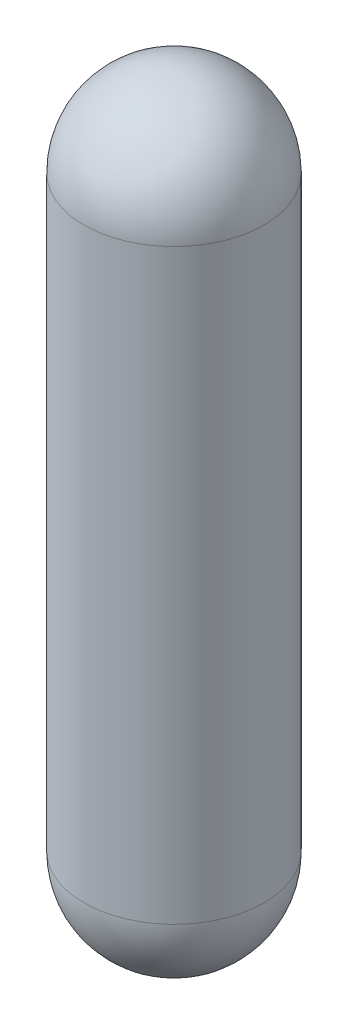
ISO-10303-21;
HEADER;
FILE_DESCRIPTION(('STEP AP214'),'2;1');
FILE_NAME('part.step','',(''),(''),'','','');
FILE_SCHEMA(('AUTOMOTIVE_DESIGN { 1 0 10303 214 1 1 1 1 }'));
ENDSEC;
DATA;
#1=APPLICATION_CONTEXT('core data for automotive mechanical design processes');
#2=APPLICATION_PROTOCOL_DEFINITION('international standard','automotive_design',2000,#1);
#3=PRODUCT_CONTEXT('',#1,'mechanical');
#4=PRODUCT('Part','Part','',(#3));
#5=PRODUCT_RELATED_PRODUCT_CATEGORY('part','',(#4));
#6=PRODUCT_DEFINITION_FORMATION('','',#4);
#7=PRODUCT_DEFINITION_CONTEXT('part definition',#1,'design');
#8=PRODUCT_DEFINITION('design','',#6,#7);
#9=PRODUCT_DEFINITION_SHAPE('','',#8);
#10=(LENGTH_UNIT() NAMED_UNIT(*) SI_UNIT(.MILLI.,.METRE.));
#11=(NAMED_UNIT(*) PLANE_ANGLE_UNIT() SI_UNIT($,.RADIAN.));
#12=(NAMED_UNIT(*) SI_UNIT($,.STERADIAN.) SOLID_ANGLE_UNIT());
#13=UNCERTAINTY_MEASURE_WITH_UNIT(LENGTH_MEASURE(1.E-05),#10,'distance_accuracy_value','');
#14=(GEOMETRIC_REPRESENTATION_CONTEXT(3) GLOBAL_UNCERTAINTY_ASSIGNED_CONTEXT((#13)) GLOBAL_UNIT_ASSIGNED_CONTEXT((#10,
#11,#12)) REPRESENTATION_CONTEXT('',''));
#15=CARTESIAN_POINT('',(0.,0.,0.));
#16=DIRECTION('',(0.,0.,1.));
#17=DIRECTION('',(1.,0.,0.));
#18=AXIS2_PLACEMENT_3D('',#15,#16,#17);
#19=CARTESIAN_POINT('',(0.,-6.77,0.));
#20=DIRECTION('',(0.,1.,0.));
#21=DIRECTION('',(1.,0.,0.));
#22=AXIS2_PLACEMENT_3D('',#19,#20,#21);
#23=SPHERICAL_SURFACE('',#22,2.);
#24=CARTESIAN_POINT('',(0.,-6.77,0.));
#25=DIRECTION('',(0.,1.,0.));
#26=DIRECTION('',(-1.,0.,0.));
#27=AXIS2_PLACEMENT_3D('',#24,#25,#26);
#28=CIRCLE('',#27,1.99999999999998);
#29=CARTESIAN_POINT('',(-1.99999999999996,-6.77,0.));
#30=VERTEX_POINT('',#29);
#31=EDGE_CURVE('E10',#30,#30,#28,.T.);
#32=ORIENTED_EDGE('',*,*,#31,.F.);
#33=EDGE_LOOP('',(#32));
#34=FACE_BOUND('',#33,.T.);
#35=ADVANCED_FACE('F32',(#34),#23,.T.);
#36=CARTESIAN_POINT('',(0.,8.27,0.));
#37=DIRECTION('',(0.,1.,0.));
#38=DIRECTION('',(-1.,0.,0.));
#39=AXIS2_PLACEMENT_3D('',#36,#37,#38);
#40=CYLINDRICAL_SURFACE('',#39,1.99999999999999);
#41=CARTESIAN_POINT('',(0.,6.27,0.));
#42=DIRECTION('',(0.,1.,0.));
#43=DIRECTION('',(-1.,0.,0.));
#44=AXIS2_PLACEMENT_3D('',#41,#42,#43);
#45=CIRCLE('',#44,2.);
#46=CARTESIAN_POINT('',(-1.99999999999998,6.27,0.));
#47=VERTEX_POINT('',#46);
#48=EDGE_CURVE('E38',#47,#47,#45,.T.);
#49=ORIENTED_EDGE('',*,*,#48,.F.);
#50=EDGE_LOOP('',(#49));
#51=FACE_BOUND('',#50,.T.);
#52=ORIENTED_EDGE('',*,*,#31,.T.);
#53=EDGE_LOOP('',(#52));
#54=FACE_BOUND('',#53,.T.);
#55=ADVANCED_FACE('F46',(#51,#54),#40,.T.);
#56=CARTESIAN_POINT('',(0.,6.27,0.));
#57=DIRECTION('',(0.,1.,0.));
#58=DIRECTION('',(1.,0.,0.));
#59=AXIS2_PLACEMENT_3D('',#56,#57,#58);
#60=SPHERICAL_SURFACE('',#59,2.);
#61=ORIENTED_EDGE('',*,*,#48,.T.);
#62=EDGE_LOOP('',(#61));
#63=FACE_BOUND('',#62,.T.);
#64=ADVANCED_FACE('F44',(#63),#60,.T.);
#65=CLOSED_SHELL('',(#35,#55,#64));
#66=MANIFOLD_SOLID_BREP('B2',#65);
#67=ADVANCED_BREP_SHAPE_REPRESENTATION('',(#18,#66),#14);
#68=SHAPE_DEFINITION_REPRESENTATION(#9,#67);
ENDSEC;
END-ISO-10303-21;
